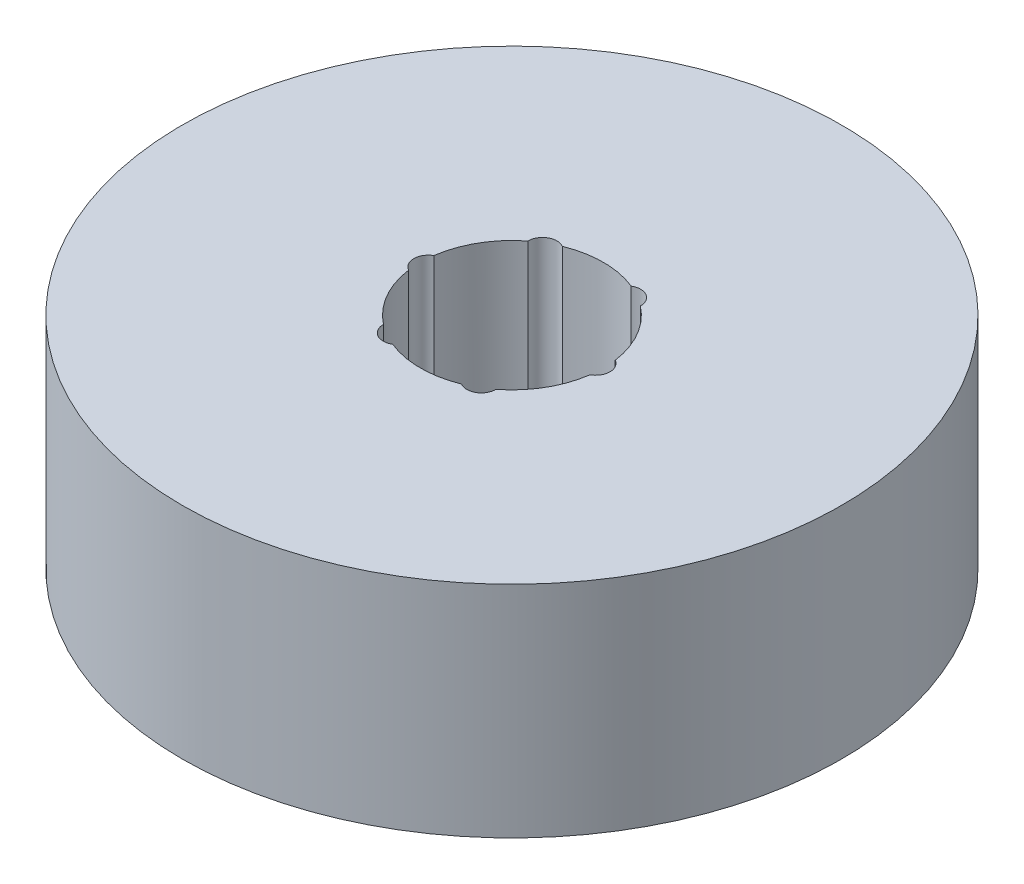
ISO-10303-21;
HEADER;
FILE_DESCRIPTION(('STEP AP214'),'2;1');
FILE_NAME('part.step','',(''),(''),'','','');
FILE_SCHEMA(('AUTOMOTIVE_DESIGN { 1 0 10303 214 1 1 1 1 }'));
ENDSEC;
DATA;
#1=APPLICATION_CONTEXT('core data for automotive mechanical design processes');
#2=APPLICATION_PROTOCOL_DEFINITION('international standard','automotive_design',2000,#1);
#3=PRODUCT_CONTEXT('',#1,'mechanical');
#4=PRODUCT('Part','Part','',(#3));
#5=PRODUCT_RELATED_PRODUCT_CATEGORY('part','',(#4));
#6=PRODUCT_DEFINITION_FORMATION('','',#4);
#7=PRODUCT_DEFINITION_CONTEXT('part definition',#1,'design');
#8=PRODUCT_DEFINITION('design','',#6,#7);
#9=PRODUCT_DEFINITION_SHAPE('','',#8);
#10=(LENGTH_UNIT() NAMED_UNIT(*) SI_UNIT(.MILLI.,.METRE.));
#11=(NAMED_UNIT(*) PLANE_ANGLE_UNIT() SI_UNIT($,.RADIAN.));
#12=(NAMED_UNIT(*) SI_UNIT($,.STERADIAN.) SOLID_ANGLE_UNIT());
#13=UNCERTAINTY_MEASURE_WITH_UNIT(LENGTH_MEASURE(1.E-05),#10,'distance_accuracy_value','');
#14=(GEOMETRIC_REPRESENTATION_CONTEXT(3) GLOBAL_UNCERTAINTY_ASSIGNED_CONTEXT((#13)) GLOBAL_UNIT_ASSIGNED_CONTEXT((#10,
#11,#12)) REPRESENTATION_CONTEXT('',''));
#15=CARTESIAN_POINT('',(0.,0.,0.));
#16=DIRECTION('',(0.,0.,1.));
#17=DIRECTION('',(1.,0.,0.));
#18=AXIS2_PLACEMENT_3D('',#15,#16,#17);
#19=CARTESIAN_POINT('',(0.,30.,0.));
#20=DIRECTION('',(0.,-1.,0.));
#21=DIRECTION('',(0.,0.,-1.));
#22=AXIS2_PLACEMENT_3D('',#19,#20,#21);
#23=CYLINDRICAL_SURFACE('',#22,45.);
#24=CARTESIAN_POINT('',(0.,30.,0.));
#25=DIRECTION('',(0.,1.,0.));
#26=DIRECTION('',(0.,0.,1.));
#27=AXIS2_PLACEMENT_3D('',#24,#25,#26);
#28=CIRCLE('',#27,45.);
#29=CARTESIAN_POINT('',(0.,30.,45.));
#30=VERTEX_POINT('',#29);
#31=EDGE_CURVE('E162',#30,#30,#28,.T.);
#32=ORIENTED_EDGE('',*,*,#31,.F.);
#33=EDGE_LOOP('',(#32));
#34=FACE_BOUND('',#33,.T.);
#35=CARTESIAN_POINT('',(0.,0.,0.));
#36=DIRECTION('',(0.,1.,0.));
#37=DIRECTION('',(0.,0.,1.));
#38=AXIS2_PLACEMENT_3D('',#35,#36,#37);
#39=CIRCLE('',#38,45.);
#40=CARTESIAN_POINT('',(0.,0.,45.));
#41=VERTEX_POINT('',#40);
#42=EDGE_CURVE('E157',#41,#41,#39,.T.);
#43=ORIENTED_EDGE('',*,*,#42,.T.);
#44=EDGE_LOOP('',(#43));
#45=FACE_BOUND('',#44,.T.);
#46=ADVANCED_FACE('F39',(#34,#45),#23,.T.);
#47=CARTESIAN_POINT('',(0.,30.,0.));
#48=DIRECTION('',(0.,1.,0.));
#49=DIRECTION('',(0.,0.,1.));
#50=AXIS2_PLACEMENT_3D('',#47,#48,#49);
#51=PLANE('',#50);
#52=CARTESIAN_POINT('',(-5.7122126143734,30.,-9.89384247173031));
#53=DIRECTION('',(0.,1.,0.));
#54=DIRECTION('',(-0.866025403784433,0.,0.50000000000001));
#55=AXIS2_PLACEMENT_3D('',#52,#53,#54);
#56=CIRCLE('',#55,1.96863067049249);
#57=CARTESIAN_POINT('',(-4.7004307018263,30.,-11.582571010675));
#58=VERTEX_POINT('',#57);
#59=CARTESIAN_POINT('',(-7.68058538546882,30.,-9.86197790184721));
#60=VERTEX_POINT('',#59);
#61=EDGE_CURVE('E218',#58,#60,#56,.T.);
#62=ORIENTED_EDGE('',*,*,#61,.F.);
#63=CARTESIAN_POINT('',(0.,30.,0.));
#64=DIRECTION('',(0.,1.,0.));
#65=DIRECTION('',(0.,0.,1.));
#66=AXIS2_PLACEMENT_3D('',#63,#64,#65);
#67=CIRCLE('',#66,12.5);
#68=CARTESIAN_POINT('',(4.70043070182606,30.,-11.5825710106751));
#69=VERTEX_POINT('',#68);
#70=EDGE_CURVE('E169',#69,#58,#67,.T.);
#71=ORIENTED_EDGE('',*,*,#70,.F.);
#72=CARTESIAN_POINT('',(5.71221261437319,30.,-9.89384247173043));
#73=DIRECTION('',(0.,1.,0.));
#74=DIRECTION('',(-0.866025403784443,0.,-0.499999999999992));
#75=AXIS2_PLACEMENT_3D('',#72,#73,#74);
#76=CIRCLE('',#75,1.96863067049249);
#77=CARTESIAN_POINT('',(7.68058538546862,30.,-9.86197790184737));
#78=VERTEX_POINT('',#77);
#79=EDGE_CURVE('E285',#78,#69,#76,.T.);
#80=ORIENTED_EDGE('',*,*,#79,.F.);
#81=CARTESIAN_POINT('',(12.3810160872949,30.,-1.72059310882775));
#82=VERTEX_POINT('',#81);
#83=EDGE_CURVE('E174',#82,#78,#67,.T.);
#84=ORIENTED_EDGE('',*,*,#83,.F.);
#85=CARTESIAN_POINT('',(11.4244252287466,30.,0.));
#86=DIRECTION('',(0.,1.,0.));
#87=DIRECTION('',(0.,0.,-1.));
#88=AXIS2_PLACEMENT_3D('',#85,#86,#87);
#89=CIRCLE('',#88,1.96863067049249);
#90=CARTESIAN_POINT('',(12.3810160872949,30.,1.72059310882775));
#91=VERTEX_POINT('',#90);
#92=EDGE_CURVE('E280',#91,#82,#89,.T.);
#93=ORIENTED_EDGE('',*,*,#92,.F.);
#94=CARTESIAN_POINT('',(7.68058538546875,30.,9.86197790184726));
#95=VERTEX_POINT('',#94);
#96=EDGE_CURVE('E164',#95,#91,#67,.T.);
#97=ORIENTED_EDGE('',*,*,#96,.F.);
#98=CARTESIAN_POINT('',(5.71221261437333,30.,9.89384247173035));
#99=DIRECTION('',(0.,1.,0.));
#100=DIRECTION('',(0.866025403784436,0.,-0.500000000000004));
#101=AXIS2_PLACEMENT_3D('',#98,#99,#100);
#102=CIRCLE('',#101,1.96863067049249);
#103=CARTESIAN_POINT('',(4.70043070182622,30.,11.582571010675));
#104=VERTEX_POINT('',#103);
#105=EDGE_CURVE('E269',#104,#95,#102,.T.);
#106=ORIENTED_EDGE('',*,*,#105,.F.);
#107=CARTESIAN_POINT('',(-4.70043070182614,30.,11.5825710106751));
#108=VERTEX_POINT('',#107);
#109=EDGE_CURVE('E149',#108,#104,#67,.T.);
#110=ORIENTED_EDGE('',*,*,#109,.F.);
#111=CARTESIAN_POINT('',(-5.71221261437326,30.,9.89384247173039));
#112=DIRECTION('',(0.,1.,0.));
#113=DIRECTION('',(0.86602540378444,0.,0.499999999999998));
#114=AXIS2_PLACEMENT_3D('',#111,#112,#113);
#115=CIRCLE('',#114,1.96863067049249);
#116=CARTESIAN_POINT('',(-7.68058538546869,30.,9.86197790184732));
#117=VERTEX_POINT('',#116);
#118=EDGE_CURVE('E128',#117,#108,#115,.T.);
#119=ORIENTED_EDGE('',*,*,#118,.F.);
#120=CARTESIAN_POINT('',(-12.3810160872949,30.,1.72059310882775));
#121=VERTEX_POINT('',#120);
#122=EDGE_CURVE('E148',#121,#117,#67,.T.);
#123=ORIENTED_EDGE('',*,*,#122,.F.);
#124=CARTESIAN_POINT('',(-11.4244252287466,30.,0.));
#125=DIRECTION('',(0.,1.,0.));
#126=DIRECTION('',(0.,0.,1.));
#127=AXIS2_PLACEMENT_3D('',#124,#125,#126);
#128=CIRCLE('',#127,1.96863067049249);
#129=CARTESIAN_POINT('',(-12.3810160872949,30.,-1.72059310882775));
#130=VERTEX_POINT('',#129);
#131=EDGE_CURVE('E179',#130,#121,#128,.T.);
#132=ORIENTED_EDGE('',*,*,#131,.F.);
#133=EDGE_CURVE('E161',#60,#130,#67,.T.);
#134=ORIENTED_EDGE('',*,*,#133,.F.);
#135=EDGE_LOOP('',(#62,#71,#80,#84,#93,#97,#106,#110,#119,#123,#132,#134));
#136=FACE_BOUND('',#135,.T.);
#137=ORIENTED_EDGE('',*,*,#31,.T.);
#138=EDGE_LOOP('',(#137));
#139=FACE_BOUND('',#138,.T.);
#140=ADVANCED_FACE('F141',(#136,#139),#51,.T.);
#141=CARTESIAN_POINT('',(0.,0.,0.));
#142=DIRECTION('',(0.,1.,0.));
#143=DIRECTION('',(0.,0.,1.));
#144=AXIS2_PLACEMENT_3D('',#141,#142,#143);
#145=PLANE('',#144);
#146=CARTESIAN_POINT('',(0.,0.,0.));
#147=DIRECTION('',(0.,1.,0.));
#148=DIRECTION('',(0.,0.,1.));
#149=AXIS2_PLACEMENT_3D('',#146,#147,#148);
#150=CIRCLE('',#149,12.5);
#151=CARTESIAN_POINT('',(0.,0.,12.5));
#152=VERTEX_POINT('',#151);
#153=EDGE_CURVE('E166',#152,#152,#150,.T.);
#154=ORIENTED_EDGE('',*,*,#153,.T.);
#155=EDGE_LOOP('',(#154));
#156=FACE_BOUND('',#155,.T.);
#157=ORIENTED_EDGE('',*,*,#42,.F.);
#158=EDGE_LOOP('',(#157));
#159=FACE_BOUND('',#158,.T.);
#160=ADVANCED_FACE('F234',(#156,#159),#145,.F.);
#161=CARTESIAN_POINT('',(0.,30.,0.));
#162=DIRECTION('',(0.,-1.,0.));
#163=DIRECTION('',(0.,0.,-1.));
#164=AXIS2_PLACEMENT_3D('',#161,#162,#163);
#165=CYLINDRICAL_SURFACE('',#164,12.5);
#166=DIRECTION('',(0.,1.,0.));
#167=VECTOR('',#166,1.);
#168=CARTESIAN_POINT('',(-4.7004307018263,18.1170808967964,-11.582571010675));
#169=LINE('',#168,#167);
#170=CARTESIAN_POINT('',(-4.7004307018263,6.23416179359278,-11.582571010675));
#171=VERTEX_POINT('',#170);
#172=EDGE_CURVE('E11',#171,#58,#169,.T.);
#173=ORIENTED_EDGE('',*,*,#172,.F.);
#174=CARTESIAN_POINT('',(0.,6.23416179359278,0.));
#175=DIRECTION('',(0.,1.,0.));
#176=DIRECTION('',(0.,0.,1.));
#177=AXIS2_PLACEMENT_3D('',#174,#175,#176);
#178=CIRCLE('',#177,12.5);
#179=CARTESIAN_POINT('',(-7.68058538546882,6.23416179359278,-9.86197790184721));
#180=VERTEX_POINT('',#179);
#181=EDGE_CURVE('E214',#171,#180,#178,.T.);
#182=ORIENTED_EDGE('',*,*,#181,.T.);
#183=DIRECTION('',(0.,1.,0.));
#184=VECTOR('',#183,1.);
#185=CARTESIAN_POINT('',(-7.68058538546882,18.1170808967964,-9.86197790184721));
#186=LINE('',#185,#184);
#187=EDGE_CURVE('E46',#60,#180,#186,.F.);
#188=ORIENTED_EDGE('',*,*,#187,.F.);
#189=ORIENTED_EDGE('',*,*,#133,.T.);
#190=DIRECTION('',(0.,1.,0.));
#191=VECTOR('',#190,1.);
#192=CARTESIAN_POINT('',(-12.3810160872949,18.1170808967964,-1.72059310882775));
#193=LINE('',#192,#191);
#194=CARTESIAN_POINT('',(-12.3810160872949,6.23416179359278,-1.72059310882775));
#195=VERTEX_POINT('',#194);
#196=EDGE_CURVE('E187',#195,#130,#193,.T.);
#197=ORIENTED_EDGE('',*,*,#196,.F.);
#198=CARTESIAN_POINT('',(0.,6.23416179359278,0.));
#199=DIRECTION('',(0.,1.,0.));
#200=DIRECTION('',(0.,0.,1.));
#201=AXIS2_PLACEMENT_3D('',#198,#199,#200);
#202=CIRCLE('',#201,12.5);
#203=CARTESIAN_POINT('',(-12.3810160872949,6.23416179359278,1.72059310882775));
#204=VERTEX_POINT('',#203);
#205=EDGE_CURVE('E184',#195,#204,#202,.T.);
#206=ORIENTED_EDGE('',*,*,#205,.T.);
#207=DIRECTION('',(0.,1.,0.));
#208=VECTOR('',#207,1.);
#209=CARTESIAN_POINT('',(-12.3810160872949,18.1170808967964,1.72059310882775));
#210=LINE('',#209,#208);
#211=EDGE_CURVE('E158',#121,#204,#210,.F.);
#212=ORIENTED_EDGE('',*,*,#211,.F.);
#213=ORIENTED_EDGE('',*,*,#122,.T.);
#214=DIRECTION('',(0.,1.,0.));
#215=VECTOR('',#214,1.);
#216=CARTESIAN_POINT('',(-7.68058538546869,18.1170808967964,9.86197790184731));
#217=LINE('',#216,#215);
#218=CARTESIAN_POINT('',(-7.68058538546869,6.23416179359278,9.86197790184732));
#219=VERTEX_POINT('',#218);
#220=EDGE_CURVE('E127',#219,#117,#217,.T.);
#221=ORIENTED_EDGE('',*,*,#220,.F.);
#222=CARTESIAN_POINT('',(0.,6.23416179359278,0.));
#223=DIRECTION('',(0.,1.,0.));
#224=DIRECTION('',(0.,0.,1.));
#225=AXIS2_PLACEMENT_3D('',#222,#223,#224);
#226=CIRCLE('',#225,12.5);
#227=CARTESIAN_POINT('',(-4.70043070182614,6.23416179359278,11.5825710106751));
#228=VERTEX_POINT('',#227);
#229=EDGE_CURVE('E189',#219,#228,#226,.T.);
#230=ORIENTED_EDGE('',*,*,#229,.T.);
#231=DIRECTION('',(0.,1.,0.));
#232=VECTOR('',#231,1.);
#233=CARTESIAN_POINT('',(-4.70043070182613,18.1170808967964,11.5825710106751));
#234=LINE('',#233,#232);
#235=EDGE_CURVE('E140',#108,#228,#234,.F.);
#236=ORIENTED_EDGE('',*,*,#235,.F.);
#237=ORIENTED_EDGE('',*,*,#109,.T.);
#238=DIRECTION('',(0.,1.,0.));
#239=VECTOR('',#238,1.);
#240=CARTESIAN_POINT('',(4.70043070182621,18.1170808967964,11.582571010675));
#241=LINE('',#240,#239);
#242=CARTESIAN_POINT('',(4.70043070182622,6.23416179359278,11.582571010675));
#243=VERTEX_POINT('',#242);
#244=EDGE_CURVE('E196',#243,#104,#241,.T.);
#245=ORIENTED_EDGE('',*,*,#244,.F.);
#246=CARTESIAN_POINT('',(0.,6.23416179359278,0.));
#247=DIRECTION('',(0.,1.,0.));
#248=DIRECTION('',(0.,0.,1.));
#249=AXIS2_PLACEMENT_3D('',#246,#247,#248);
#250=CIRCLE('',#249,12.5);
#251=CARTESIAN_POINT('',(7.68058538546875,6.23416179359278,9.86197790184726));
#252=VERTEX_POINT('',#251);
#253=EDGE_CURVE('E136',#243,#252,#250,.T.);
#254=ORIENTED_EDGE('',*,*,#253,.T.);
#255=DIRECTION('',(0.,1.,0.));
#256=VECTOR('',#255,1.);
#257=CARTESIAN_POINT('',(7.68058538546875,18.1170808967964,9.86197790184726));
#258=LINE('',#257,#256);
#259=EDGE_CURVE('E194',#95,#252,#258,.F.);
#260=ORIENTED_EDGE('',*,*,#259,.F.);
#261=ORIENTED_EDGE('',*,*,#96,.T.);
#262=DIRECTION('',(0.,1.,0.));
#263=VECTOR('',#262,1.);
#264=CARTESIAN_POINT('',(12.3810160872949,18.1170808967964,1.72059310882775));
#265=LINE('',#264,#263);
#266=CARTESIAN_POINT('',(12.3810160872949,6.23416179359278,1.72059310882775));
#267=VERTEX_POINT('',#266);
#268=EDGE_CURVE('E206',#267,#91,#265,.T.);
#269=ORIENTED_EDGE('',*,*,#268,.F.);
#270=CARTESIAN_POINT('',(0.,6.23416179359278,0.));
#271=DIRECTION('',(0.,1.,0.));
#272=DIRECTION('',(0.,0.,1.));
#273=AXIS2_PLACEMENT_3D('',#270,#271,#272);
#274=CIRCLE('',#273,12.5);
#275=CARTESIAN_POINT('',(12.3810160872949,6.23416179359278,-1.72059310882775));
#276=VERTEX_POINT('',#275);
#277=EDGE_CURVE('E199',#267,#276,#274,.T.);
#278=ORIENTED_EDGE('',*,*,#277,.T.);
#279=DIRECTION('',(0.,1.,0.));
#280=VECTOR('',#279,1.);
#281=CARTESIAN_POINT('',(12.3810160872949,18.1170808967964,-1.72059310882775));
#282=LINE('',#281,#280);
#283=EDGE_CURVE('E201',#82,#276,#282,.F.);
#284=ORIENTED_EDGE('',*,*,#283,.F.);
#285=ORIENTED_EDGE('',*,*,#83,.T.);
#286=DIRECTION('',(0.,1.,0.));
#287=VECTOR('',#286,1.);
#288=CARTESIAN_POINT('',(7.68058538546862,18.1170808967964,-9.86197790184737));
#289=LINE('',#288,#287);
#290=CARTESIAN_POINT('',(7.68058538546862,6.23416179359278,-9.86197790184737));
#291=VERTEX_POINT('',#290);
#292=EDGE_CURVE('E213',#291,#78,#289,.T.);
#293=ORIENTED_EDGE('',*,*,#292,.F.);
#294=CARTESIAN_POINT('',(0.,6.23416179359278,0.));
#295=DIRECTION('',(0.,1.,0.));
#296=DIRECTION('',(0.,0.,1.));
#297=AXIS2_PLACEMENT_3D('',#294,#295,#296);
#298=CIRCLE('',#297,12.5);
#299=CARTESIAN_POINT('',(4.70043070182606,6.23416179359278,-11.5825710106751));
#300=VERTEX_POINT('',#299);
#301=EDGE_CURVE('E208',#291,#300,#298,.T.);
#302=ORIENTED_EDGE('',*,*,#301,.T.);
#303=DIRECTION('',(0.,1.,0.));
#304=VECTOR('',#303,1.);
#305=CARTESIAN_POINT('',(4.70043070182605,18.1170808967964,-11.5825710106751));
#306=LINE('',#305,#304);
#307=EDGE_CURVE('E211',#69,#300,#306,.F.);
#308=ORIENTED_EDGE('',*,*,#307,.F.);
#309=ORIENTED_EDGE('',*,*,#70,.T.);
#310=EDGE_LOOP('',(#173,#182,#188,#189,#197,#206,#212,#213,#221,#230,#236,#237,#245,#254,#260,
#261,#269,#278,#284,#285,#293,#302,#308,#309));
#311=FACE_BOUND('',#310,.T.);
#312=ORIENTED_EDGE('',*,*,#153,.F.);
#313=EDGE_LOOP('',(#312));
#314=FACE_BOUND('',#313,.T.);
#315=ADVANCED_FACE('F152',(#311,#314),#165,.F.);
#316=CARTESIAN_POINT('',(-11.4244252287466,6.23416179359278,0.));
#317=DIRECTION('',(0.,1.,0.));
#318=DIRECTION('',(0.,0.,1.));
#319=AXIS2_PLACEMENT_3D('',#316,#317,#318);
#320=CYLINDRICAL_SURFACE('',#319,1.96863067049249);
#321=ORIENTED_EDGE('',*,*,#196,.T.);
#322=ORIENTED_EDGE('',*,*,#131,.T.);
#323=ORIENTED_EDGE('',*,*,#211,.T.);
#324=CARTESIAN_POINT('',(-11.4244252287466,6.23416179359278,0.));
#325=DIRECTION('',(0.,1.,0.));
#326=DIRECTION('',(0.,0.,1.));
#327=AXIS2_PLACEMENT_3D('',#324,#325,#326);
#328=CIRCLE('',#327,1.96863067049249);
#329=EDGE_CURVE('E180',#195,#204,#328,.T.);
#330=ORIENTED_EDGE('',*,*,#329,.F.);
#331=EDGE_LOOP('',(#321,#322,#323,#330));
#332=FACE_BOUND('',#331,.T.);
#333=ADVANCED_FACE('F244',(#332),#320,.F.);
#334=CARTESIAN_POINT('',(-11.4244252287466,6.23416179359278,0.));
#335=DIRECTION('',(0.,1.,0.));
#336=DIRECTION('',(0.,0.,1.));
#337=AXIS2_PLACEMENT_3D('',#334,#335,#336);
#338=PLANE('',#337);
#339=ORIENTED_EDGE('',*,*,#329,.T.);
#340=ORIENTED_EDGE('',*,*,#205,.F.);
#341=EDGE_LOOP('',(#339,#340));
#342=FACE_BOUND('',#341,.T.);
#343=ADVANCED_FACE('F248',(#342),#338,.T.);
#344=CARTESIAN_POINT('',(-5.71221261437326,6.23416179359278,9.89384247173039));
#345=DIRECTION('',(0.,1.,0.));
#346=DIRECTION('',(0.,0.,1.));
#347=AXIS2_PLACEMENT_3D('',#344,#345,#346);
#348=CYLINDRICAL_SURFACE('',#347,1.96863067049249);
#349=ORIENTED_EDGE('',*,*,#220,.T.);
#350=ORIENTED_EDGE('',*,*,#118,.T.);
#351=ORIENTED_EDGE('',*,*,#235,.T.);
#352=CARTESIAN_POINT('',(-5.71221261437326,6.23416179359278,9.89384247173039));
#353=DIRECTION('',(0.,1.,0.));
#354=DIRECTION('',(0.86602540378444,0.,0.499999999999998));
#355=AXIS2_PLACEMENT_3D('',#352,#353,#354);
#356=CIRCLE('',#355,1.96863067049249);
#357=EDGE_CURVE('E135',#219,#228,#356,.T.);
#358=ORIENTED_EDGE('',*,*,#357,.F.);
#359=EDGE_LOOP('',(#349,#350,#351,#358));
#360=FACE_BOUND('',#359,.T.);
#361=ADVANCED_FACE('F126',(#360),#348,.F.);
#362=CARTESIAN_POINT('',(-5.71221261437326,6.23416179359278,9.89384247173039));
#363=DIRECTION('',(0.,1.,0.));
#364=DIRECTION('',(0.86602540378444,0.,0.499999999999998));
#365=AXIS2_PLACEMENT_3D('',#362,#363,#364);
#366=PLANE('',#365);
#367=ORIENTED_EDGE('',*,*,#357,.T.);
#368=ORIENTED_EDGE('',*,*,#229,.F.);
#369=EDGE_LOOP('',(#367,#368));
#370=FACE_BOUND('',#369,.T.);
#371=ADVANCED_FACE('F258',(#370),#366,.T.);
#372=CARTESIAN_POINT('',(5.71221261437333,6.23416179359278,9.89384247173035));
#373=DIRECTION('',(0.,1.,0.));
#374=DIRECTION('',(0.,0.,1.));
#375=AXIS2_PLACEMENT_3D('',#372,#373,#374);
#376=CYLINDRICAL_SURFACE('',#375,1.96863067049249);
#377=ORIENTED_EDGE('',*,*,#244,.T.);
#378=ORIENTED_EDGE('',*,*,#105,.T.);
#379=ORIENTED_EDGE('',*,*,#259,.T.);
#380=CARTESIAN_POINT('',(5.71221261437333,6.23416179359278,9.89384247173035));
#381=DIRECTION('',(0.,1.,0.));
#382=DIRECTION('',(0.866025403784436,0.,-0.500000000000004));
#383=AXIS2_PLACEMENT_3D('',#380,#381,#382);
#384=CIRCLE('',#383,1.96863067049249);
#385=EDGE_CURVE('E147',#243,#252,#384,.T.);
#386=ORIENTED_EDGE('',*,*,#385,.F.);
#387=EDGE_LOOP('',(#377,#378,#379,#386));
#388=FACE_BOUND('',#387,.T.);
#389=ADVANCED_FACE('F256',(#388),#376,.F.);
#390=CARTESIAN_POINT('',(5.71221261437333,6.23416179359278,9.89384247173035));
#391=DIRECTION('',(0.,1.,0.));
#392=DIRECTION('',(0.866025403784436,0.,-0.500000000000004));
#393=AXIS2_PLACEMENT_3D('',#390,#391,#392);
#394=PLANE('',#393);
#395=ORIENTED_EDGE('',*,*,#385,.T.);
#396=ORIENTED_EDGE('',*,*,#253,.F.);
#397=EDGE_LOOP('',(#395,#396));
#398=FACE_BOUND('',#397,.T.);
#399=ADVANCED_FACE('F263',(#398),#394,.T.);
#400=CARTESIAN_POINT('',(11.4244252287466,6.23416179359278,0.));
#401=DIRECTION('',(0.,1.,0.));
#402=DIRECTION('',(0.,0.,1.));
#403=AXIS2_PLACEMENT_3D('',#400,#401,#402);
#404=CYLINDRICAL_SURFACE('',#403,1.96863067049249);
#405=ORIENTED_EDGE('',*,*,#268,.T.);
#406=ORIENTED_EDGE('',*,*,#92,.T.);
#407=ORIENTED_EDGE('',*,*,#283,.T.);
#408=CARTESIAN_POINT('',(11.4244252287466,6.23416179359278,0.));
#409=DIRECTION('',(0.,1.,0.));
#410=DIRECTION('',(0.,0.,-1.));
#411=AXIS2_PLACEMENT_3D('',#408,#409,#410);
#412=CIRCLE('',#411,1.96863067049249);
#413=EDGE_CURVE('E273',#267,#276,#412,.T.);
#414=ORIENTED_EDGE('',*,*,#413,.F.);
#415=EDGE_LOOP('',(#405,#406,#407,#414));
#416=FACE_BOUND('',#415,.T.);
#417=ADVANCED_FACE('F297',(#416),#404,.F.);
#418=CARTESIAN_POINT('',(11.4244252287466,6.23416179359278,0.));
#419=DIRECTION('',(0.,1.,0.));
#420=DIRECTION('',(0.,0.,-1.));
#421=AXIS2_PLACEMENT_3D('',#418,#419,#420);
#422=PLANE('',#421);
#423=ORIENTED_EDGE('',*,*,#413,.T.);
#424=ORIENTED_EDGE('',*,*,#277,.F.);
#425=EDGE_LOOP('',(#423,#424));
#426=FACE_BOUND('',#425,.T.);
#427=ADVANCED_FACE('F299',(#426),#422,.T.);
#428=CARTESIAN_POINT('',(5.71221261437319,6.23416179359278,-9.89384247173043));
#429=DIRECTION('',(0.,1.,0.));
#430=DIRECTION('',(0.,0.,1.));
#431=AXIS2_PLACEMENT_3D('',#428,#429,#430);
#432=CYLINDRICAL_SURFACE('',#431,1.96863067049249);
#433=ORIENTED_EDGE('',*,*,#292,.T.);
#434=ORIENTED_EDGE('',*,*,#79,.T.);
#435=ORIENTED_EDGE('',*,*,#307,.T.);
#436=CARTESIAN_POINT('',(5.71221261437319,6.23416179359278,-9.89384247173043));
#437=DIRECTION('',(0.,1.,0.));
#438=DIRECTION('',(-0.866025403784443,0.,-0.499999999999992));
#439=AXIS2_PLACEMENT_3D('',#436,#437,#438);
#440=CIRCLE('',#439,1.96863067049249);
#441=EDGE_CURVE('E56',#291,#300,#440,.T.);
#442=ORIENTED_EDGE('',*,*,#441,.F.);
#443=EDGE_LOOP('',(#433,#434,#435,#442));
#444=FACE_BOUND('',#443,.T.);
#445=ADVANCED_FACE('F292',(#444),#432,.F.);
#446=CARTESIAN_POINT('',(5.71221261437319,6.23416179359278,-9.89384247173043));
#447=DIRECTION('',(0.,1.,0.));
#448=DIRECTION('',(-0.866025403784443,0.,-0.499999999999992));
#449=AXIS2_PLACEMENT_3D('',#446,#447,#448);
#450=PLANE('',#449);
#451=ORIENTED_EDGE('',*,*,#441,.T.);
#452=ORIENTED_EDGE('',*,*,#301,.F.);
#453=EDGE_LOOP('',(#451,#452));
#454=FACE_BOUND('',#453,.T.);
#455=ADVANCED_FACE('F226',(#454),#450,.T.);
#456=CARTESIAN_POINT('',(-5.7122126143734,6.23416179359278,-9.89384247173031));
#457=DIRECTION('',(0.,1.,0.));
#458=DIRECTION('',(0.,0.,1.));
#459=AXIS2_PLACEMENT_3D('',#456,#457,#458);
#460=CYLINDRICAL_SURFACE('',#459,1.96863067049249);
#461=ORIENTED_EDGE('',*,*,#172,.T.);
#462=ORIENTED_EDGE('',*,*,#61,.T.);
#463=ORIENTED_EDGE('',*,*,#187,.T.);
#464=CARTESIAN_POINT('',(-5.7122126143734,6.23416179359278,-9.89384247173031));
#465=DIRECTION('',(0.,1.,0.));
#466=DIRECTION('',(-0.866025403784433,0.,0.50000000000001));
#467=AXIS2_PLACEMENT_3D('',#464,#465,#466);
#468=CIRCLE('',#467,1.96863067049249);
#469=EDGE_CURVE('E55',#171,#180,#468,.T.);
#470=ORIENTED_EDGE('',*,*,#469,.F.);
#471=EDGE_LOOP('',(#461,#462,#463,#470));
#472=FACE_BOUND('',#471,.T.);
#473=ADVANCED_FACE('F217',(#472),#460,.F.);
#474=CARTESIAN_POINT('',(-5.7122126143734,6.23416179359278,-9.89384247173031));
#475=DIRECTION('',(0.,1.,0.));
#476=DIRECTION('',(-0.866025403784433,0.,0.50000000000001));
#477=AXIS2_PLACEMENT_3D('',#474,#475,#476);
#478=PLANE('',#477);
#479=ORIENTED_EDGE('',*,*,#469,.T.);
#480=ORIENTED_EDGE('',*,*,#181,.F.);
#481=EDGE_LOOP('',(#479,#480));
#482=FACE_BOUND('',#481,.T.);
#483=ADVANCED_FACE('F219',(#482),#478,.T.);
#484=CLOSED_SHELL('',(#46,#140,#160,#315,#333,#343,#361,#371,#389,#399,#417,#427,#445,#455,#473,#483));
#485=MANIFOLD_SOLID_BREP('B2',#484);
#486=ADVANCED_BREP_SHAPE_REPRESENTATION('',(#18,#485),#14);
#487=SHAPE_DEFINITION_REPRESENTATION(#9,#486);
ENDSEC;
END-ISO-10303-21;
